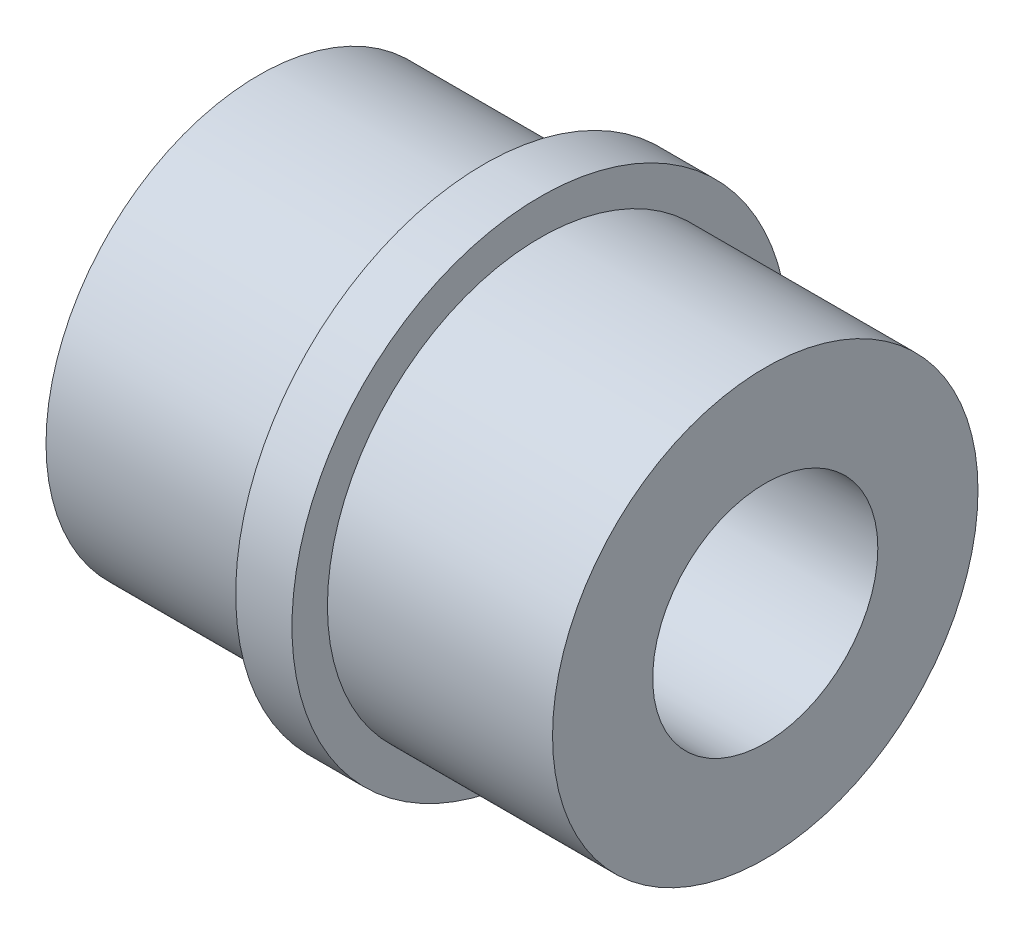
ISO-10303-21;
HEADER;
FILE_DESCRIPTION(('STEP AP214'),'2;1');
FILE_NAME('part.step','',(''),(''),'','','');
FILE_SCHEMA(('AUTOMOTIVE_DESIGN { 1 0 10303 214 1 1 1 1 }'));
ENDSEC;
DATA;
#1=APPLICATION_CONTEXT('core data for automotive mechanical design processes');
#2=APPLICATION_PROTOCOL_DEFINITION('international standard','automotive_design',2000,#1);
#3=PRODUCT_CONTEXT('',#1,'mechanical');
#4=PRODUCT('Part','Part','',(#3));
#5=PRODUCT_RELATED_PRODUCT_CATEGORY('part','',(#4));
#6=PRODUCT_DEFINITION_FORMATION('','',#4);
#7=PRODUCT_DEFINITION_CONTEXT('part definition',#1,'design');
#8=PRODUCT_DEFINITION('design','',#6,#7);
#9=PRODUCT_DEFINITION_SHAPE('','',#8);
#10=(LENGTH_UNIT() NAMED_UNIT(*) SI_UNIT(.MILLI.,.METRE.));
#11=(NAMED_UNIT(*) PLANE_ANGLE_UNIT() SI_UNIT($,.RADIAN.));
#12=(NAMED_UNIT(*) SI_UNIT($,.STERADIAN.) SOLID_ANGLE_UNIT());
#13=UNCERTAINTY_MEASURE_WITH_UNIT(LENGTH_MEASURE(1.E-05),#10,'distance_accuracy_value','');
#14=(GEOMETRIC_REPRESENTATION_CONTEXT(3) GLOBAL_UNCERTAINTY_ASSIGNED_CONTEXT((#13)) GLOBAL_UNIT_ASSIGNED_CONTEXT((#10,
#11,#12)) REPRESENTATION_CONTEXT('',''));
#15=CARTESIAN_POINT('',(0.,0.,0.));
#16=DIRECTION('',(0.,0.,1.));
#17=DIRECTION('',(1.,0.,0.));
#18=AXIS2_PLACEMENT_3D('',#15,#16,#17);
#19=CARTESIAN_POINT('',(6.35,0.,0.));
#20=DIRECTION('',(-1.,0.,0.));
#21=DIRECTION('',(0.,0.,1.));
#22=AXIS2_PLACEMENT_3D('',#19,#20,#21);
#23=CYLINDRICAL_SURFACE('',#22,5.999999938);
#24=CARTESIAN_POINT('',(6.35,0.,0.));
#25=DIRECTION('',(1.,0.,0.));
#26=DIRECTION('',(0.,0.,-1.));
#27=AXIS2_PLACEMENT_3D('',#24,#25,#26);
#28=CIRCLE('',#27,5.999999938);
#29=CARTESIAN_POINT('',(6.35,0.,-5.999999938));
#30=VERTEX_POINT('',#29);
#31=EDGE_CURVE('E38',#30,#30,#28,.T.);
#32=ORIENTED_EDGE('',*,*,#31,.F.);
#33=EDGE_LOOP('',(#32));
#34=FACE_BOUND('',#33,.T.);
#35=CARTESIAN_POINT('',(0.,0.,0.));
#36=DIRECTION('',(1.,0.,0.));
#37=DIRECTION('',(0.,0.,-1.));
#38=AXIS2_PLACEMENT_3D('',#35,#36,#37);
#39=CIRCLE('',#38,5.999999938);
#40=CARTESIAN_POINT('',(0.,0.,-5.999999938));
#41=VERTEX_POINT('',#40);
#42=EDGE_CURVE('E34',#41,#41,#39,.T.);
#43=ORIENTED_EDGE('',*,*,#42,.T.);
#44=EDGE_LOOP('',(#43));
#45=FACE_BOUND('',#44,.T.);
#46=ADVANCED_FACE('F31',(#34,#45),#23,.T.);
#47=CARTESIAN_POINT('',(0.,0.,0.));
#48=DIRECTION('',(1.,0.,0.));
#49=DIRECTION('',(0.,0.,-1.));
#50=AXIS2_PLACEMENT_3D('',#47,#48,#49);
#51=PLANE('',#50);
#52=CARTESIAN_POINT('',(0.,0.,0.));
#53=DIRECTION('',(1.,0.,0.));
#54=DIRECTION('',(0.,0.,-1.));
#55=AXIS2_PLACEMENT_3D('',#52,#53,#54);
#56=CIRCLE('',#55,3.175);
#57=CARTESIAN_POINT('',(0.,0.,-3.175));
#58=VERTEX_POINT('',#57);
#59=EDGE_CURVE('E55',#58,#58,#56,.T.);
#60=ORIENTED_EDGE('',*,*,#59,.T.);
#61=EDGE_LOOP('',(#60));
#62=FACE_BOUND('',#61,.T.);
#63=ORIENTED_EDGE('',*,*,#42,.F.);
#64=EDGE_LOOP('',(#63));
#65=FACE_BOUND('',#64,.T.);
#66=ADVANCED_FACE('F82',(#62,#65),#51,.F.);
#67=CARTESIAN_POINT('',(7.9375,0.,0.));
#68=DIRECTION('',(-1.,0.,0.));
#69=DIRECTION('',(0.,0.,1.));
#70=AXIS2_PLACEMENT_3D('',#67,#68,#69);
#71=CYLINDRICAL_SURFACE('',#70,6.99999997);
#72=CARTESIAN_POINT('',(7.9375,0.,0.));
#73=DIRECTION('',(1.,0.,0.));
#74=DIRECTION('',(0.,0.,-1.));
#75=AXIS2_PLACEMENT_3D('',#72,#73,#74);
#76=CIRCLE('',#75,6.99999997);
#77=CARTESIAN_POINT('',(7.9375,0.,-6.99999997));
#78=VERTEX_POINT('',#77);
#79=EDGE_CURVE('E47',#78,#78,#76,.T.);
#80=ORIENTED_EDGE('',*,*,#79,.F.);
#81=EDGE_LOOP('',(#80));
#82=FACE_BOUND('',#81,.T.);
#83=CARTESIAN_POINT('',(6.35,0.,0.));
#84=DIRECTION('',(1.,0.,0.));
#85=DIRECTION('',(0.,0.,-1.));
#86=AXIS2_PLACEMENT_3D('',#83,#84,#85);
#87=CIRCLE('',#86,6.99999997);
#88=CARTESIAN_POINT('',(6.35,0.,-6.99999997));
#89=VERTEX_POINT('',#88);
#90=EDGE_CURVE('E50',#89,#89,#87,.T.);
#91=ORIENTED_EDGE('',*,*,#90,.T.);
#92=EDGE_LOOP('',(#91));
#93=FACE_BOUND('',#92,.T.);
#94=ADVANCED_FACE('F87',(#82,#93),#71,.T.);
#95=CARTESIAN_POINT('',(7.9375,0.,0.));
#96=DIRECTION('',(1.,0.,0.));
#97=DIRECTION('',(0.,0.,-1.));
#98=AXIS2_PLACEMENT_3D('',#95,#96,#97);
#99=PLANE('',#98);
#100=CARTESIAN_POINT('',(7.9375,0.,0.));
#101=DIRECTION('',(1.,0.,0.));
#102=DIRECTION('',(0.,0.,-1.));
#103=AXIS2_PLACEMENT_3D('',#100,#101,#102);
#104=CIRCLE('',#103,5.999999938);
#105=CARTESIAN_POINT('',(7.9375,0.,-5.999999938));
#106=VERTEX_POINT('',#105);
#107=EDGE_CURVE('E10',#106,#106,#104,.T.);
#108=ORIENTED_EDGE('',*,*,#107,.F.);
#109=EDGE_LOOP('',(#108));
#110=FACE_BOUND('',#109,.T.);
#111=ORIENTED_EDGE('',*,*,#79,.T.);
#112=EDGE_LOOP('',(#111));
#113=FACE_BOUND('',#112,.T.);
#114=ADVANCED_FACE('F96',(#110,#113),#99,.T.);
#115=CARTESIAN_POINT('',(6.35,0.,0.));
#116=DIRECTION('',(1.,0.,0.));
#117=DIRECTION('',(0.,0.,-1.));
#118=AXIS2_PLACEMENT_3D('',#115,#116,#117);
#119=PLANE('',#118);
#120=ORIENTED_EDGE('',*,*,#31,.T.);
#121=EDGE_LOOP('',(#120));
#122=FACE_BOUND('',#121,.T.);
#123=ORIENTED_EDGE('',*,*,#90,.F.);
#124=EDGE_LOOP('',(#123));
#125=FACE_BOUND('',#124,.T.);
#126=ADVANCED_FACE('F78',(#122,#125),#119,.F.);
#127=CARTESIAN_POINT('',(14.2875,0.,0.));
#128=DIRECTION('',(-1.,0.,0.));
#129=DIRECTION('',(0.,0.,1.));
#130=AXIS2_PLACEMENT_3D('',#127,#128,#129);
#131=CYLINDRICAL_SURFACE('',#130,5.999999938);
#132=CARTESIAN_POINT('',(14.2875,0.,0.));
#133=DIRECTION('',(1.,0.,0.));
#134=DIRECTION('',(0.,0.,-1.));
#135=AXIS2_PLACEMENT_3D('',#132,#133,#134);
#136=CIRCLE('',#135,5.999999938);
#137=CARTESIAN_POINT('',(14.2875,0.,-5.999999938));
#138=VERTEX_POINT('',#137);
#139=EDGE_CURVE('E45',#138,#138,#136,.T.);
#140=ORIENTED_EDGE('',*,*,#139,.F.);
#141=EDGE_LOOP('',(#140));
#142=FACE_BOUND('',#141,.T.);
#143=ORIENTED_EDGE('',*,*,#107,.T.);
#144=EDGE_LOOP('',(#143));
#145=FACE_BOUND('',#144,.T.);
#146=ADVANCED_FACE('F70',(#142,#145),#131,.T.);
#147=CARTESIAN_POINT('',(14.2875,0.,0.));
#148=DIRECTION('',(1.,0.,0.));
#149=DIRECTION('',(0.,0.,-1.));
#150=AXIS2_PLACEMENT_3D('',#147,#148,#149);
#151=PLANE('',#150);
#152=CARTESIAN_POINT('',(14.2875,0.,0.));
#153=DIRECTION('',(1.,0.,0.));
#154=DIRECTION('',(0.,0.,-1.));
#155=AXIS2_PLACEMENT_3D('',#152,#153,#154);
#156=CIRCLE('',#155,3.175);
#157=CARTESIAN_POINT('',(14.2875,0.,-3.175));
#158=VERTEX_POINT('',#157);
#159=EDGE_CURVE('E59',#158,#158,#156,.T.);
#160=ORIENTED_EDGE('',*,*,#159,.F.);
#161=EDGE_LOOP('',(#160));
#162=FACE_BOUND('',#161,.T.);
#163=ORIENTED_EDGE('',*,*,#139,.T.);
#164=EDGE_LOOP('',(#163));
#165=FACE_BOUND('',#164,.T.);
#166=ADVANCED_FACE('F68',(#162,#165),#151,.T.);
#167=CARTESIAN_POINT('',(0.,0.,0.));
#168=DIRECTION('',(1.,0.,0.));
#169=DIRECTION('',(0.,0.,-1.));
#170=AXIS2_PLACEMENT_3D('',#167,#168,#169);
#171=CYLINDRICAL_SURFACE('',#170,3.175);
#172=ORIENTED_EDGE('',*,*,#59,.F.);
#173=EDGE_LOOP('',(#172));
#174=FACE_BOUND('',#173,.T.);
#175=ORIENTED_EDGE('',*,*,#159,.T.);
#176=EDGE_LOOP('',(#175));
#177=FACE_BOUND('',#176,.T.);
#178=ADVANCED_FACE('F66',(#174,#177),#171,.F.);
#179=CLOSED_SHELL('',(#46,#66,#94,#114,#126,#146,#166,#178));
#180=MANIFOLD_SOLID_BREP('B2',#179);
#181=ADVANCED_BREP_SHAPE_REPRESENTATION('',(#18,#180),#14);
#182=SHAPE_DEFINITION_REPRESENTATION(#9,#181);
ENDSEC;
END-ISO-10303-21;
